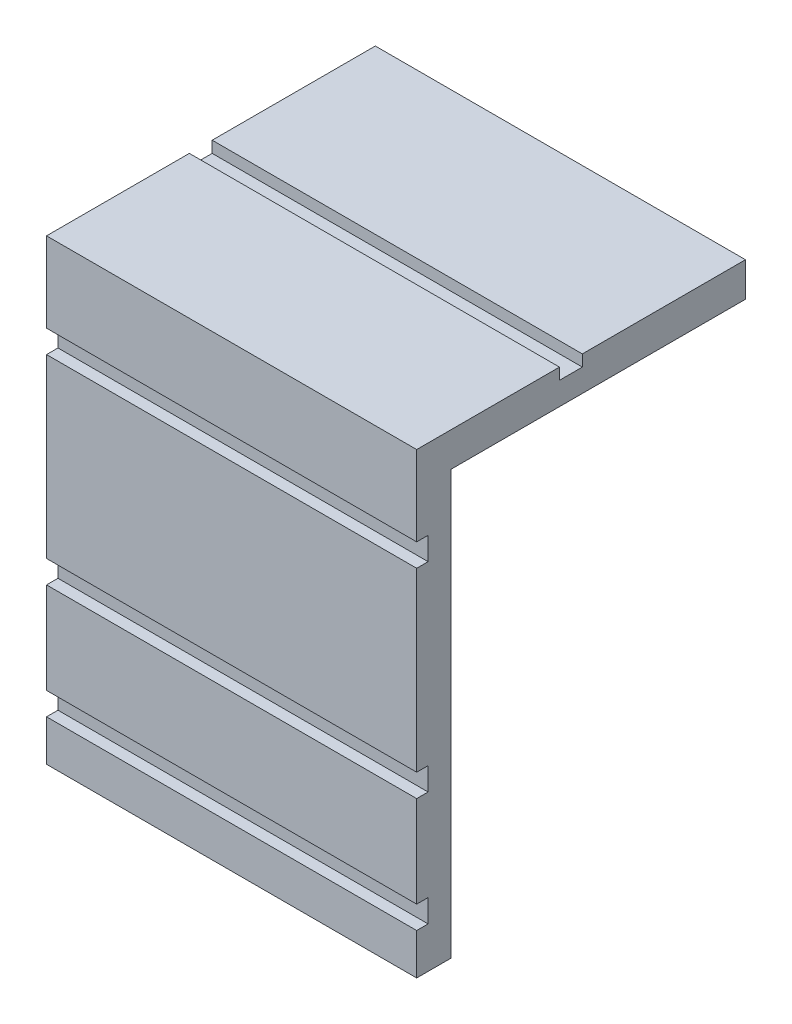
ISO-10303-21;
HEADER;
FILE_DESCRIPTION(('STEP AP214'),'2;1');
FILE_NAME('part.step','',(''),(''),'','','');
FILE_SCHEMA(('AUTOMOTIVE_DESIGN { 1 0 10303 214 1 1 1 1 }'));
ENDSEC;
DATA;
#1=APPLICATION_CONTEXT('core data for automotive mechanical design processes');
#2=APPLICATION_PROTOCOL_DEFINITION('international standard','automotive_design',2000,#1);
#3=PRODUCT_CONTEXT('',#1,'mechanical');
#4=PRODUCT('Part','Part','',(#3));
#5=PRODUCT_RELATED_PRODUCT_CATEGORY('part','',(#4));
#6=PRODUCT_DEFINITION_FORMATION('','',#4);
#7=PRODUCT_DEFINITION_CONTEXT('part definition',#1,'design');
#8=PRODUCT_DEFINITION('design','',#6,#7);
#9=PRODUCT_DEFINITION_SHAPE('','',#8);
#10=(LENGTH_UNIT() NAMED_UNIT(*) SI_UNIT(.MILLI.,.METRE.));
#11=(NAMED_UNIT(*) PLANE_ANGLE_UNIT() SI_UNIT($,.RADIAN.));
#12=(NAMED_UNIT(*) SI_UNIT($,.STERADIAN.) SOLID_ANGLE_UNIT());
#13=UNCERTAINTY_MEASURE_WITH_UNIT(LENGTH_MEASURE(1.E-05),#10,'distance_accuracy_value','');
#14=(GEOMETRIC_REPRESENTATION_CONTEXT(3) GLOBAL_UNCERTAINTY_ASSIGNED_CONTEXT((#13)) GLOBAL_UNIT_ASSIGNED_CONTEXT((#10,
#11,#12)) REPRESENTATION_CONTEXT('',''));
#15=CARTESIAN_POINT('',(0.,0.,0.));
#16=DIRECTION('',(0.,0.,1.));
#17=DIRECTION('',(1.,0.,0.));
#18=AXIS2_PLACEMENT_3D('',#15,#16,#17);
#19=CARTESIAN_POINT('',(16.2,0.,-1.5));
#20=DIRECTION('',(0.,1.,0.));
#21=DIRECTION('',(0.,0.,1.));
#22=AXIS2_PLACEMENT_3D('',#19,#20,#21);
#23=PLANE('',#22);
#24=DIRECTION('',(0.,0.,-1.));
#25=VECTOR('',#24,1.);
#26=CARTESIAN_POINT('',(0.,0.,-1.5));
#27=LINE('',#26,#25);
#28=CARTESIAN_POINT('',(0.,0.,0.));
#29=VERTEX_POINT('',#28);
#30=CARTESIAN_POINT('',(0.,0.,-1.5));
#31=VERTEX_POINT('',#30);
#32=EDGE_CURVE('E214',#29,#31,#27,.T.);
#33=ORIENTED_EDGE('',*,*,#32,.T.);
#34=DIRECTION('',(-1.,0.,0.));
#35=VECTOR('',#34,1.);
#36=CARTESIAN_POINT('',(16.2,0.,-1.5));
#37=LINE('',#36,#35);
#38=CARTESIAN_POINT('',(16.2,0.,-1.5));
#39=VERTEX_POINT('',#38);
#40=EDGE_CURVE('E11',#39,#31,#37,.T.);
#41=ORIENTED_EDGE('',*,*,#40,.F.);
#42=DIRECTION('',(0.,0.,-1.));
#43=VECTOR('',#42,1.);
#44=CARTESIAN_POINT('',(16.2,0.,-1.5));
#45=LINE('',#44,#43);
#46=CARTESIAN_POINT('',(16.2,0.,0.));
#47=VERTEX_POINT('',#46);
#48=EDGE_CURVE('E256',#47,#39,#45,.T.);
#49=ORIENTED_EDGE('',*,*,#48,.F.);
#50=DIRECTION('',(-1.,0.,0.));
#51=VECTOR('',#50,1.);
#52=CARTESIAN_POINT('',(16.2,0.,0.));
#53=LINE('',#52,#51);
#54=EDGE_CURVE('E210',#47,#29,#53,.T.);
#55=ORIENTED_EDGE('',*,*,#54,.T.);
#56=EDGE_LOOP('',(#33,#41,#49,#55));
#57=FACE_BOUND('',#56,.T.);
#58=ADVANCED_FACE('F34',(#57),#23,.F.);
#59=CARTESIAN_POINT('',(16.2,18.53,-1.5));
#60=DIRECTION('',(0.,0.,1.));
#61=DIRECTION('',(0.,-1.,0.));
#62=AXIS2_PLACEMENT_3D('',#59,#60,#61);
#63=PLANE('',#62);
#64=DIRECTION('',(0.,1.,0.));
#65=VECTOR('',#64,1.);
#66=CARTESIAN_POINT('',(0.,18.53,-1.5));
#67=LINE('',#66,#65);
#68=CARTESIAN_POINT('',(0.,18.53,-1.5));
#69=VERTEX_POINT('',#68);
#70=EDGE_CURVE('E217',#31,#69,#67,.T.);
#71=ORIENTED_EDGE('',*,*,#70,.T.);
#72=DIRECTION('',(-1.,0.,0.));
#73=VECTOR('',#72,1.);
#74=CARTESIAN_POINT('',(16.2,18.53,-1.5));
#75=LINE('',#74,#73);
#76=CARTESIAN_POINT('',(16.2,18.53,-1.5));
#77=VERTEX_POINT('',#76);
#78=EDGE_CURVE('E42',#77,#69,#75,.T.);
#79=ORIENTED_EDGE('',*,*,#78,.F.);
#80=DIRECTION('',(0.,1.,0.));
#81=VECTOR('',#80,1.);
#82=CARTESIAN_POINT('',(16.2,18.53,-1.5));
#83=LINE('',#82,#81);
#84=EDGE_CURVE('E135',#39,#77,#83,.T.);
#85=ORIENTED_EDGE('',*,*,#84,.F.);
#86=ORIENTED_EDGE('',*,*,#40,.T.);
#87=EDGE_LOOP('',(#71,#79,#85,#86));
#88=FACE_BOUND('',#87,.T.);
#89=ADVANCED_FACE('F384',(#88),#63,.F.);
#90=CARTESIAN_POINT('',(16.2,18.53,-14.39));
#91=DIRECTION('',(0.,1.,0.));
#92=DIRECTION('',(0.,0.,1.));
#93=AXIS2_PLACEMENT_3D('',#90,#91,#92);
#94=PLANE('',#93);
#95=DIRECTION('',(0.,0.,-1.));
#96=VECTOR('',#95,1.);
#97=CARTESIAN_POINT('',(0.,18.53,-14.39));
#98=LINE('',#97,#96);
#99=CARTESIAN_POINT('',(0.,18.53,-14.39));
#100=VERTEX_POINT('',#99);
#101=EDGE_CURVE('E219',#69,#100,#98,.T.);
#102=ORIENTED_EDGE('',*,*,#101,.T.);
#103=DIRECTION('',(-1.,0.,0.));
#104=VECTOR('',#103,1.);
#105=CARTESIAN_POINT('',(16.2,18.53,-14.39));
#106=LINE('',#105,#104);
#107=CARTESIAN_POINT('',(16.2,18.53,-14.39));
#108=VERTEX_POINT('',#107);
#109=EDGE_CURVE('E305',#108,#100,#106,.T.);
#110=ORIENTED_EDGE('',*,*,#109,.F.);
#111=DIRECTION('',(0.,0.,-1.));
#112=VECTOR('',#111,1.);
#113=CARTESIAN_POINT('',(16.2,18.53,-14.39));
#114=LINE('',#113,#112);
#115=EDGE_CURVE('E313',#77,#108,#114,.T.);
#116=ORIENTED_EDGE('',*,*,#115,.F.);
#117=ORIENTED_EDGE('',*,*,#78,.T.);
#118=EDGE_LOOP('',(#102,#110,#116,#117));
#119=FACE_BOUND('',#118,.T.);
#120=ADVANCED_FACE('F311',(#119),#94,.F.);
#121=CARTESIAN_POINT('',(16.2,20.03,-14.39));
#122=DIRECTION('',(0.,0.,1.));
#123=DIRECTION('',(1.,0.,0.));
#124=AXIS2_PLACEMENT_3D('',#121,#122,#123);
#125=PLANE('',#124);
#126=DIRECTION('',(0.,1.,0.));
#127=VECTOR('',#126,1.);
#128=CARTESIAN_POINT('',(0.,20.03,-14.39));
#129=LINE('',#128,#127);
#130=CARTESIAN_POINT('',(0.,20.03,-14.39));
#131=VERTEX_POINT('',#130);
#132=EDGE_CURVE('E221',#100,#131,#129,.T.);
#133=ORIENTED_EDGE('',*,*,#132,.T.);
#134=DIRECTION('',(-1.,0.,0.));
#135=VECTOR('',#134,1.);
#136=CARTESIAN_POINT('',(16.2,20.03,-14.39));
#137=LINE('',#136,#135);
#138=CARTESIAN_POINT('',(16.2,20.03,-14.39));
#139=VERTEX_POINT('',#138);
#140=EDGE_CURVE('E302',#139,#131,#137,.T.);
#141=ORIENTED_EDGE('',*,*,#140,.F.);
#142=DIRECTION('',(0.,1.,0.));
#143=VECTOR('',#142,1.);
#144=CARTESIAN_POINT('',(16.2,20.03,-14.39));
#145=LINE('',#144,#143);
#146=EDGE_CURVE('E331',#108,#139,#145,.T.);
#147=ORIENTED_EDGE('',*,*,#146,.F.);
#148=ORIENTED_EDGE('',*,*,#109,.T.);
#149=EDGE_LOOP('',(#133,#141,#147,#148));
#150=FACE_BOUND('',#149,.T.);
#151=ADVANCED_FACE('F322',(#150),#125,.F.);
#152=CARTESIAN_POINT('',(16.2,20.03,-7.25));
#153=DIRECTION('',(0.,-1.,0.));
#154=DIRECTION('',(0.,0.,-1.));
#155=AXIS2_PLACEMENT_3D('',#152,#153,#154);
#156=PLANE('',#155);
#157=DIRECTION('',(0.,0.,1.));
#158=VECTOR('',#157,1.);
#159=CARTESIAN_POINT('',(0.,20.03,-7.25));
#160=LINE('',#159,#158);
#161=CARTESIAN_POINT('',(0.,20.03,-7.25));
#162=VERTEX_POINT('',#161);
#163=EDGE_CURVE('E223',#131,#162,#160,.T.);
#164=ORIENTED_EDGE('',*,*,#163,.T.);
#165=DIRECTION('',(-1.,0.,0.));
#166=VECTOR('',#165,1.);
#167=CARTESIAN_POINT('',(16.2,20.03,-7.25));
#168=LINE('',#167,#166);
#169=CARTESIAN_POINT('',(16.2,20.03,-7.25));
#170=VERTEX_POINT('',#169);
#171=EDGE_CURVE('E299',#170,#162,#168,.T.);
#172=ORIENTED_EDGE('',*,*,#171,.F.);
#173=DIRECTION('',(0.,0.,1.));
#174=VECTOR('',#173,1.);
#175=CARTESIAN_POINT('',(16.2,20.03,-7.25));
#176=LINE('',#175,#174);
#177=EDGE_CURVE('E328',#139,#170,#176,.T.);
#178=ORIENTED_EDGE('',*,*,#177,.F.);
#179=ORIENTED_EDGE('',*,*,#140,.T.);
#180=EDGE_LOOP('',(#164,#172,#178,#179));
#181=FACE_BOUND('',#180,.T.);
#182=ADVANCED_FACE('F326',(#181),#156,.F.);
#183=CARTESIAN_POINT('',(16.2,19.53,-7.25));
#184=DIRECTION('',(0.,0.,-1.));
#185=DIRECTION('',(-1.,0.,0.));
#186=AXIS2_PLACEMENT_3D('',#183,#184,#185);
#187=PLANE('',#186);
#188=DIRECTION('',(0.,-1.,0.));
#189=VECTOR('',#188,1.);
#190=CARTESIAN_POINT('',(0.,19.53,-7.25));
#191=LINE('',#190,#189);
#192=CARTESIAN_POINT('',(0.,19.53,-7.25));
#193=VERTEX_POINT('',#192);
#194=EDGE_CURVE('E225',#162,#193,#191,.T.);
#195=ORIENTED_EDGE('',*,*,#194,.T.);
#196=DIRECTION('',(-1.,0.,0.));
#197=VECTOR('',#196,1.);
#198=CARTESIAN_POINT('',(16.2,19.53,-7.25));
#199=LINE('',#198,#197);
#200=CARTESIAN_POINT('',(16.2,19.53,-7.25));
#201=VERTEX_POINT('',#200);
#202=EDGE_CURVE('E296',#201,#193,#199,.T.);
#203=ORIENTED_EDGE('',*,*,#202,.F.);
#204=DIRECTION('',(0.,-1.,0.));
#205=VECTOR('',#204,1.);
#206=CARTESIAN_POINT('',(16.2,19.53,-7.25));
#207=LINE('',#206,#205);
#208=EDGE_CURVE('E330',#170,#201,#207,.T.);
#209=ORIENTED_EDGE('',*,*,#208,.F.);
#210=ORIENTED_EDGE('',*,*,#171,.T.);
#211=EDGE_LOOP('',(#195,#203,#209,#210));
#212=FACE_BOUND('',#211,.T.);
#213=ADVANCED_FACE('F397',(#212),#187,.F.);
#214=CARTESIAN_POINT('',(16.2,19.53,-6.25));
#215=DIRECTION('',(0.,-1.,0.));
#216=DIRECTION('',(0.,0.,-1.));
#217=AXIS2_PLACEMENT_3D('',#214,#215,#216);
#218=PLANE('',#217);
#219=DIRECTION('',(0.,0.,1.));
#220=VECTOR('',#219,1.);
#221=CARTESIAN_POINT('',(0.,19.53,-6.25));
#222=LINE('',#221,#220);
#223=CARTESIAN_POINT('',(0.,19.53,-6.25));
#224=VERTEX_POINT('',#223);
#225=EDGE_CURVE('E227',#193,#224,#222,.T.);
#226=ORIENTED_EDGE('',*,*,#225,.T.);
#227=DIRECTION('',(-1.,0.,0.));
#228=VECTOR('',#227,1.);
#229=CARTESIAN_POINT('',(16.2,19.53,-6.25));
#230=LINE('',#229,#228);
#231=CARTESIAN_POINT('',(16.2,19.53,-6.25));
#232=VERTEX_POINT('',#231);
#233=EDGE_CURVE('E293',#232,#224,#230,.T.);
#234=ORIENTED_EDGE('',*,*,#233,.F.);
#235=DIRECTION('',(0.,0.,1.));
#236=VECTOR('',#235,1.);
#237=CARTESIAN_POINT('',(16.2,19.53,-6.25));
#238=LINE('',#237,#236);
#239=EDGE_CURVE('E333',#201,#232,#238,.T.);
#240=ORIENTED_EDGE('',*,*,#239,.F.);
#241=ORIENTED_EDGE('',*,*,#202,.T.);
#242=EDGE_LOOP('',(#226,#234,#240,#241));
#243=FACE_BOUND('',#242,.T.);
#244=ADVANCED_FACE('F400',(#243),#218,.F.);
#245=CARTESIAN_POINT('',(16.2,20.03,-6.25));
#246=DIRECTION('',(0.,0.,1.));
#247=DIRECTION('',(1.,0.,0.));
#248=AXIS2_PLACEMENT_3D('',#245,#246,#247);
#249=PLANE('',#248);
#250=DIRECTION('',(0.,1.,0.));
#251=VECTOR('',#250,1.);
#252=CARTESIAN_POINT('',(0.,20.03,-6.25));
#253=LINE('',#252,#251);
#254=CARTESIAN_POINT('',(0.,20.03,-6.25));
#255=VERTEX_POINT('',#254);
#256=EDGE_CURVE('E229',#224,#255,#253,.T.);
#257=ORIENTED_EDGE('',*,*,#256,.T.);
#258=DIRECTION('',(-1.,0.,0.));
#259=VECTOR('',#258,1.);
#260=CARTESIAN_POINT('',(16.2,20.03,-6.25));
#261=LINE('',#260,#259);
#262=CARTESIAN_POINT('',(16.2,20.03,-6.25));
#263=VERTEX_POINT('',#262);
#264=EDGE_CURVE('E290',#263,#255,#261,.T.);
#265=ORIENTED_EDGE('',*,*,#264,.F.);
#266=DIRECTION('',(0.,1.,0.));
#267=VECTOR('',#266,1.);
#268=CARTESIAN_POINT('',(16.2,20.03,-6.25));
#269=LINE('',#268,#267);
#270=EDGE_CURVE('E339',#232,#263,#269,.T.);
#271=ORIENTED_EDGE('',*,*,#270,.F.);
#272=ORIENTED_EDGE('',*,*,#233,.T.);
#273=EDGE_LOOP('',(#257,#265,#271,#272));
#274=FACE_BOUND('',#273,.T.);
#275=ADVANCED_FACE('F404',(#274),#249,.F.);
#276=CARTESIAN_POINT('',(16.2,20.03,0.));
#277=DIRECTION('',(0.,-1.,0.));
#278=DIRECTION('',(0.,0.,-1.));
#279=AXIS2_PLACEMENT_3D('',#276,#277,#278);
#280=PLANE('',#279);
#281=DIRECTION('',(0.,0.,1.));
#282=VECTOR('',#281,1.);
#283=CARTESIAN_POINT('',(0.,20.03,0.));
#284=LINE('',#283,#282);
#285=CARTESIAN_POINT('',(0.,20.03,0.));
#286=VERTEX_POINT('',#285);
#287=EDGE_CURVE('E231',#255,#286,#284,.T.);
#288=ORIENTED_EDGE('',*,*,#287,.T.);
#289=DIRECTION('',(-1.,0.,0.));
#290=VECTOR('',#289,1.);
#291=CARTESIAN_POINT('',(16.2,20.03,0.));
#292=LINE('',#291,#290);
#293=CARTESIAN_POINT('',(16.2,20.03,0.));
#294=VERTEX_POINT('',#293);
#295=EDGE_CURVE('E287',#294,#286,#292,.T.);
#296=ORIENTED_EDGE('',*,*,#295,.F.);
#297=DIRECTION('',(0.,0.,1.));
#298=VECTOR('',#297,1.);
#299=CARTESIAN_POINT('',(16.2,20.03,0.));
#300=LINE('',#299,#298);
#301=EDGE_CURVE('E341',#263,#294,#300,.T.);
#302=ORIENTED_EDGE('',*,*,#301,.F.);
#303=ORIENTED_EDGE('',*,*,#264,.T.);
#304=EDGE_LOOP('',(#288,#296,#302,#303));
#305=FACE_BOUND('',#304,.T.);
#306=ADVANCED_FACE('F408',(#305),#280,.F.);
#307=CARTESIAN_POINT('',(16.2,16.53,0.));
#308=DIRECTION('',(0.,0.,-1.));
#309=DIRECTION('',(-1.,0.,0.));
#310=AXIS2_PLACEMENT_3D('',#307,#308,#309);
#311=PLANE('',#310);
#312=DIRECTION('',(0.,-1.,0.));
#313=VECTOR('',#312,1.);
#314=CARTESIAN_POINT('',(0.,16.53,0.));
#315=LINE('',#314,#313);
#316=CARTESIAN_POINT('',(0.,16.53,0.));
#317=VERTEX_POINT('',#316);
#318=EDGE_CURVE('E233',#286,#317,#315,.T.);
#319=ORIENTED_EDGE('',*,*,#318,.T.);
#320=DIRECTION('',(-1.,0.,0.));
#321=VECTOR('',#320,1.);
#322=CARTESIAN_POINT('',(16.2,16.53,0.));
#323=LINE('',#322,#321);
#324=CARTESIAN_POINT('',(16.2,16.53,0.));
#325=VERTEX_POINT('',#324);
#326=EDGE_CURVE('E284',#325,#317,#323,.T.);
#327=ORIENTED_EDGE('',*,*,#326,.F.);
#328=DIRECTION('',(0.,-1.,0.));
#329=VECTOR('',#328,1.);
#330=CARTESIAN_POINT('',(16.2,16.53,0.));
#331=LINE('',#330,#329);
#332=EDGE_CURVE('E343',#294,#325,#331,.T.);
#333=ORIENTED_EDGE('',*,*,#332,.F.);
#334=ORIENTED_EDGE('',*,*,#295,.T.);
#335=EDGE_LOOP('',(#319,#327,#333,#334));
#336=FACE_BOUND('',#335,.T.);
#337=ADVANCED_FACE('F412',(#336),#311,.F.);
#338=CARTESIAN_POINT('',(16.2,16.53,0.));
#339=DIRECTION('',(0.,1.,0.));
#340=DIRECTION('',(0.,0.,1.));
#341=AXIS2_PLACEMENT_3D('',#338,#339,#340);
#342=PLANE('',#341);
#343=DIRECTION('',(0.,0.,-1.));
#344=VECTOR('',#343,1.);
#345=CARTESIAN_POINT('',(0.,16.53,0.));
#346=LINE('',#345,#344);
#347=CARTESIAN_POINT('',(0.,16.53,-0.5));
#348=VERTEX_POINT('',#347);
#349=EDGE_CURVE('E235',#317,#348,#346,.T.);
#350=ORIENTED_EDGE('',*,*,#349,.T.);
#351=DIRECTION('',(-1.,0.,0.));
#352=VECTOR('',#351,1.);
#353=CARTESIAN_POINT('',(16.2,16.53,-0.5));
#354=LINE('',#353,#352);
#355=CARTESIAN_POINT('',(16.2,16.53,-0.5));
#356=VERTEX_POINT('',#355);
#357=EDGE_CURVE('E281',#356,#348,#354,.T.);
#358=ORIENTED_EDGE('',*,*,#357,.F.);
#359=DIRECTION('',(0.,0.,-1.));
#360=VECTOR('',#359,1.);
#361=CARTESIAN_POINT('',(16.2,16.53,0.));
#362=LINE('',#361,#360);
#363=EDGE_CURVE('E345',#325,#356,#362,.T.);
#364=ORIENTED_EDGE('',*,*,#363,.F.);
#365=ORIENTED_EDGE('',*,*,#326,.T.);
#366=EDGE_LOOP('',(#350,#358,#364,#365));
#367=FACE_BOUND('',#366,.T.);
#368=ADVANCED_FACE('F416',(#367),#342,.F.);
#369=CARTESIAN_POINT('',(16.2,16.53,-0.5));
#370=DIRECTION('',(0.,0.,-1.));
#371=DIRECTION('',(0.,1.,0.));
#372=AXIS2_PLACEMENT_3D('',#369,#370,#371);
#373=PLANE('',#372);
#374=DIRECTION('',(0.,-1.,0.));
#375=VECTOR('',#374,1.);
#376=CARTESIAN_POINT('',(0.,16.53,-0.5));
#377=LINE('',#376,#375);
#378=CARTESIAN_POINT('',(0.,15.53,-0.5));
#379=VERTEX_POINT('',#378);
#380=EDGE_CURVE('E237',#348,#379,#377,.T.);
#381=ORIENTED_EDGE('',*,*,#380,.T.);
#382=DIRECTION('',(-1.,0.,0.));
#383=VECTOR('',#382,1.);
#384=CARTESIAN_POINT('',(16.2,15.53,-0.5));
#385=LINE('',#384,#383);
#386=CARTESIAN_POINT('',(16.2,15.53,-0.5));
#387=VERTEX_POINT('',#386);
#388=EDGE_CURVE('E278',#387,#379,#385,.T.);
#389=ORIENTED_EDGE('',*,*,#388,.F.);
#390=DIRECTION('',(0.,-1.,0.));
#391=VECTOR('',#390,1.);
#392=CARTESIAN_POINT('',(16.2,16.53,-0.5));
#393=LINE('',#392,#391);
#394=EDGE_CURVE('E347',#356,#387,#393,.T.);
#395=ORIENTED_EDGE('',*,*,#394,.F.);
#396=ORIENTED_EDGE('',*,*,#357,.T.);
#397=EDGE_LOOP('',(#381,#389,#395,#396));
#398=FACE_BOUND('',#397,.T.);
#399=ADVANCED_FACE('F420',(#398),#373,.F.);
#400=CARTESIAN_POINT('',(16.2,15.53,-0.5));
#401=DIRECTION('',(0.,-1.,0.));
#402=DIRECTION('',(0.,0.,-1.));
#403=AXIS2_PLACEMENT_3D('',#400,#401,#402);
#404=PLANE('',#403);
#405=DIRECTION('',(0.,0.,1.));
#406=VECTOR('',#405,1.);
#407=CARTESIAN_POINT('',(0.,15.53,-0.5));
#408=LINE('',#407,#406);
#409=CARTESIAN_POINT('',(0.,15.53,0.));
#410=VERTEX_POINT('',#409);
#411=EDGE_CURVE('E239',#379,#410,#408,.T.);
#412=ORIENTED_EDGE('',*,*,#411,.T.);
#413=DIRECTION('',(-1.,0.,0.));
#414=VECTOR('',#413,1.);
#415=CARTESIAN_POINT('',(16.2,15.53,0.));
#416=LINE('',#415,#414);
#417=CARTESIAN_POINT('',(16.2,15.53,0.));
#418=VERTEX_POINT('',#417);
#419=EDGE_CURVE('E275',#418,#410,#416,.T.);
#420=ORIENTED_EDGE('',*,*,#419,.F.);
#421=DIRECTION('',(0.,0.,1.));
#422=VECTOR('',#421,1.);
#423=CARTESIAN_POINT('',(16.2,15.53,-0.5));
#424=LINE('',#423,#422);
#425=EDGE_CURVE('E349',#387,#418,#424,.T.);
#426=ORIENTED_EDGE('',*,*,#425,.F.);
#427=ORIENTED_EDGE('',*,*,#388,.T.);
#428=EDGE_LOOP('',(#412,#420,#426,#427));
#429=FACE_BOUND('',#428,.T.);
#430=ADVANCED_FACE('F424',(#429),#404,.F.);
#431=CARTESIAN_POINT('',(16.2,7.8,0.));
#432=DIRECTION('',(0.,0.,-1.));
#433=DIRECTION('',(-1.,0.,0.));
#434=AXIS2_PLACEMENT_3D('',#431,#432,#433);
#435=PLANE('',#434);
#436=DIRECTION('',(0.,-1.,0.));
#437=VECTOR('',#436,1.);
#438=CARTESIAN_POINT('',(0.,7.8,0.));
#439=LINE('',#438,#437);
#440=CARTESIAN_POINT('',(0.,7.8,0.));
#441=VERTEX_POINT('',#440);
#442=EDGE_CURVE('E241',#410,#441,#439,.T.);
#443=ORIENTED_EDGE('',*,*,#442,.T.);
#444=DIRECTION('',(-1.,0.,0.));
#445=VECTOR('',#444,1.);
#446=CARTESIAN_POINT('',(16.2,7.8,0.));
#447=LINE('',#446,#445);
#448=CARTESIAN_POINT('',(16.2,7.8,0.));
#449=VERTEX_POINT('',#448);
#450=EDGE_CURVE('E272',#449,#441,#447,.T.);
#451=ORIENTED_EDGE('',*,*,#450,.F.);
#452=DIRECTION('',(0.,-1.,0.));
#453=VECTOR('',#452,1.);
#454=CARTESIAN_POINT('',(16.2,7.8,0.));
#455=LINE('',#454,#453);
#456=EDGE_CURVE('E351',#418,#449,#455,.T.);
#457=ORIENTED_EDGE('',*,*,#456,.F.);
#458=ORIENTED_EDGE('',*,*,#419,.T.);
#459=EDGE_LOOP('',(#443,#451,#457,#458));
#460=FACE_BOUND('',#459,.T.);
#461=ADVANCED_FACE('F428',(#460),#435,.F.);
#462=CARTESIAN_POINT('',(16.2,7.8,0.));
#463=DIRECTION('',(0.,1.,0.));
#464=DIRECTION('',(0.,0.,1.));
#465=AXIS2_PLACEMENT_3D('',#462,#463,#464);
#466=PLANE('',#465);
#467=DIRECTION('',(0.,0.,-1.));
#468=VECTOR('',#467,1.);
#469=CARTESIAN_POINT('',(0.,7.8,0.));
#470=LINE('',#469,#468);
#471=CARTESIAN_POINT('',(0.,7.8,-0.499999999999998));
#472=VERTEX_POINT('',#471);
#473=EDGE_CURVE('E243',#441,#472,#470,.T.);
#474=ORIENTED_EDGE('',*,*,#473,.T.);
#475=DIRECTION('',(-1.,0.,0.));
#476=VECTOR('',#475,1.);
#477=CARTESIAN_POINT('',(16.2,7.8,-0.499999999999998));
#478=LINE('',#477,#476);
#479=CARTESIAN_POINT('',(16.2,7.8,-0.499999999999998));
#480=VERTEX_POINT('',#479);
#481=EDGE_CURVE('E269',#480,#472,#478,.T.);
#482=ORIENTED_EDGE('',*,*,#481,.F.);
#483=DIRECTION('',(0.,0.,-1.));
#484=VECTOR('',#483,1.);
#485=CARTESIAN_POINT('',(16.2,7.8,0.));
#486=LINE('',#485,#484);
#487=EDGE_CURVE('E353',#449,#480,#486,.T.);
#488=ORIENTED_EDGE('',*,*,#487,.F.);
#489=ORIENTED_EDGE('',*,*,#450,.T.);
#490=EDGE_LOOP('',(#474,#482,#488,#489));
#491=FACE_BOUND('',#490,.T.);
#492=ADVANCED_FACE('F432',(#491),#466,.F.);
#493=CARTESIAN_POINT('',(16.2,7.8,-0.499999999999998));
#494=DIRECTION('',(0.,0.,-1.));
#495=DIRECTION('',(0.,1.,0.));
#496=AXIS2_PLACEMENT_3D('',#493,#494,#495);
#497=PLANE('',#496);
#498=DIRECTION('',(0.,-1.,0.));
#499=VECTOR('',#498,1.);
#500=CARTESIAN_POINT('',(0.,7.8,-0.499999999999998));
#501=LINE('',#500,#499);
#502=CARTESIAN_POINT('',(0.,6.8,-0.499999999999999));
#503=VERTEX_POINT('',#502);
#504=EDGE_CURVE('E245',#472,#503,#501,.T.);
#505=ORIENTED_EDGE('',*,*,#504,.T.);
#506=DIRECTION('',(-1.,0.,0.));
#507=VECTOR('',#506,1.);
#508=CARTESIAN_POINT('',(16.2,6.8,-0.499999999999999));
#509=LINE('',#508,#507);
#510=CARTESIAN_POINT('',(16.2,6.8,-0.499999999999999));
#511=VERTEX_POINT('',#510);
#512=EDGE_CURVE('E266',#511,#503,#509,.T.);
#513=ORIENTED_EDGE('',*,*,#512,.F.);
#514=DIRECTION('',(0.,-1.,0.));
#515=VECTOR('',#514,1.);
#516=CARTESIAN_POINT('',(16.2,7.8,-0.499999999999998));
#517=LINE('',#516,#515);
#518=EDGE_CURVE('E355',#480,#511,#517,.T.);
#519=ORIENTED_EDGE('',*,*,#518,.F.);
#520=ORIENTED_EDGE('',*,*,#481,.T.);
#521=EDGE_LOOP('',(#505,#513,#519,#520));
#522=FACE_BOUND('',#521,.T.);
#523=ADVANCED_FACE('F436',(#522),#497,.F.);
#524=CARTESIAN_POINT('',(16.2,6.8,-0.499999999999999));
#525=DIRECTION('',(0.,-1.,0.));
#526=DIRECTION('',(0.,0.,-1.));
#527=AXIS2_PLACEMENT_3D('',#524,#525,#526);
#528=PLANE('',#527);
#529=DIRECTION('',(0.,0.,1.));
#530=VECTOR('',#529,1.);
#531=CARTESIAN_POINT('',(0.,6.8,-0.499999999999999));
#532=LINE('',#531,#530);
#533=CARTESIAN_POINT('',(0.,6.8,0.));
#534=VERTEX_POINT('',#533);
#535=EDGE_CURVE('E247',#503,#534,#532,.T.);
#536=ORIENTED_EDGE('',*,*,#535,.T.);
#537=DIRECTION('',(-1.,0.,0.));
#538=VECTOR('',#537,1.);
#539=CARTESIAN_POINT('',(16.2,6.8,0.));
#540=LINE('',#539,#538);
#541=CARTESIAN_POINT('',(16.2,6.8,0.));
#542=VERTEX_POINT('',#541);
#543=EDGE_CURVE('E263',#542,#534,#540,.T.);
#544=ORIENTED_EDGE('',*,*,#543,.F.);
#545=DIRECTION('',(0.,0.,1.));
#546=VECTOR('',#545,1.);
#547=CARTESIAN_POINT('',(16.2,6.8,-0.499999999999999));
#548=LINE('',#547,#546);
#549=EDGE_CURVE('E357',#511,#542,#548,.T.);
#550=ORIENTED_EDGE('',*,*,#549,.F.);
#551=ORIENTED_EDGE('',*,*,#512,.T.);
#552=EDGE_LOOP('',(#536,#544,#550,#551));
#553=FACE_BOUND('',#552,.T.);
#554=ADVANCED_FACE('F440',(#553),#528,.F.);
#555=CARTESIAN_POINT('',(16.2,2.8,0.));
#556=DIRECTION('',(0.,0.,-1.));
#557=DIRECTION('',(0.,1.,0.));
#558=AXIS2_PLACEMENT_3D('',#555,#556,#557);
#559=PLANE('',#558);
#560=DIRECTION('',(0.,-1.,0.));
#561=VECTOR('',#560,1.);
#562=CARTESIAN_POINT('',(0.,2.8,0.));
#563=LINE('',#562,#561);
#564=CARTESIAN_POINT('',(0.,2.8,0.));
#565=VERTEX_POINT('',#564);
#566=EDGE_CURVE('E249',#534,#565,#563,.T.);
#567=ORIENTED_EDGE('',*,*,#566,.T.);
#568=DIRECTION('',(-1.,0.,0.));
#569=VECTOR('',#568,1.);
#570=CARTESIAN_POINT('',(16.2,2.8,0.));
#571=LINE('',#570,#569);
#572=CARTESIAN_POINT('',(16.2,2.8,0.));
#573=VERTEX_POINT('',#572);
#574=EDGE_CURVE('E260',#573,#565,#571,.T.);
#575=ORIENTED_EDGE('',*,*,#574,.F.);
#576=DIRECTION('',(0.,-1.,0.));
#577=VECTOR('',#576,1.);
#578=CARTESIAN_POINT('',(16.2,2.8,0.));
#579=LINE('',#578,#577);
#580=EDGE_CURVE('E359',#542,#573,#579,.T.);
#581=ORIENTED_EDGE('',*,*,#580,.F.);
#582=ORIENTED_EDGE('',*,*,#543,.T.);
#583=EDGE_LOOP('',(#567,#575,#581,#582));
#584=FACE_BOUND('',#583,.T.);
#585=ADVANCED_FACE('F365',(#584),#559,.F.);
#586=CARTESIAN_POINT('',(16.2,2.8,-0.5));
#587=DIRECTION('',(0.,1.,0.));
#588=DIRECTION('',(0.,0.,1.));
#589=AXIS2_PLACEMENT_3D('',#586,#587,#588);
#590=PLANE('',#589);
#591=DIRECTION('',(0.,0.,-1.));
#592=VECTOR('',#591,1.);
#593=CARTESIAN_POINT('',(0.,2.8,-0.5));
#594=LINE('',#593,#592);
#595=CARTESIAN_POINT('',(0.,2.8,-0.5));
#596=VERTEX_POINT('',#595);
#597=EDGE_CURVE('E251',#565,#596,#594,.T.);
#598=ORIENTED_EDGE('',*,*,#597,.T.);
#599=DIRECTION('',(-1.,0.,0.));
#600=VECTOR('',#599,1.);
#601=CARTESIAN_POINT('',(16.2,2.8,-0.5));
#602=LINE('',#601,#600);
#603=CARTESIAN_POINT('',(16.2,2.8,-0.5));
#604=VERTEX_POINT('',#603);
#605=EDGE_CURVE('E205',#604,#596,#602,.T.);
#606=ORIENTED_EDGE('',*,*,#605,.F.);
#607=DIRECTION('',(0.,0.,-1.));
#608=VECTOR('',#607,1.);
#609=CARTESIAN_POINT('',(16.2,2.8,-0.5));
#610=LINE('',#609,#608);
#611=EDGE_CURVE('E196',#573,#604,#610,.T.);
#612=ORIENTED_EDGE('',*,*,#611,.F.);
#613=ORIENTED_EDGE('',*,*,#574,.T.);
#614=EDGE_LOOP('',(#598,#606,#612,#613));
#615=FACE_BOUND('',#614,.T.);
#616=ADVANCED_FACE('F369',(#615),#590,.F.);
#617=CARTESIAN_POINT('',(16.2,1.8,-0.5));
#618=DIRECTION('',(0.,0.,-1.));
#619=DIRECTION('',(-1.,0.,0.));
#620=AXIS2_PLACEMENT_3D('',#617,#618,#619);
#621=PLANE('',#620);
#622=DIRECTION('',(0.,-1.,0.));
#623=VECTOR('',#622,1.);
#624=CARTESIAN_POINT('',(0.,1.8,-0.5));
#625=LINE('',#624,#623);
#626=CARTESIAN_POINT('',(0.,1.8,-0.5));
#627=VERTEX_POINT('',#626);
#628=EDGE_CURVE('E204',#596,#627,#625,.T.);
#629=ORIENTED_EDGE('',*,*,#628,.T.);
#630=DIRECTION('',(-1.,0.,0.));
#631=VECTOR('',#630,1.);
#632=CARTESIAN_POINT('',(16.2,1.8,-0.5));
#633=LINE('',#632,#631);
#634=CARTESIAN_POINT('',(16.2,1.8,-0.5));
#635=VERTEX_POINT('',#634);
#636=EDGE_CURVE('E201',#635,#627,#633,.T.);
#637=ORIENTED_EDGE('',*,*,#636,.F.);
#638=DIRECTION('',(0.,-1.,0.));
#639=VECTOR('',#638,1.);
#640=CARTESIAN_POINT('',(16.2,1.8,-0.5));
#641=LINE('',#640,#639);
#642=EDGE_CURVE('E190',#604,#635,#641,.T.);
#643=ORIENTED_EDGE('',*,*,#642,.F.);
#644=ORIENTED_EDGE('',*,*,#605,.T.);
#645=EDGE_LOOP('',(#629,#637,#643,#644));
#646=FACE_BOUND('',#645,.T.);
#647=ADVANCED_FACE('F202',(#646),#621,.F.);
#648=CARTESIAN_POINT('',(16.2,1.8,0.));
#649=DIRECTION('',(0.,-1.,0.));
#650=DIRECTION('',(0.,0.,-1.));
#651=AXIS2_PLACEMENT_3D('',#648,#649,#650);
#652=PLANE('',#651);
#653=DIRECTION('',(0.,0.,1.));
#654=VECTOR('',#653,1.);
#655=CARTESIAN_POINT('',(0.,1.8,0.));
#656=LINE('',#655,#654);
#657=CARTESIAN_POINT('',(0.,1.8,0.));
#658=VERTEX_POINT('',#657);
#659=EDGE_CURVE('E121',#627,#658,#656,.T.);
#660=ORIENTED_EDGE('',*,*,#659,.T.);
#661=DIRECTION('',(-1.,0.,0.));
#662=VECTOR('',#661,1.);
#663=CARTESIAN_POINT('',(16.2,1.8,0.));
#664=LINE('',#663,#662);
#665=CARTESIAN_POINT('',(16.2,1.8,0.));
#666=VERTEX_POINT('',#665);
#667=EDGE_CURVE('E206',#666,#658,#664,.T.);
#668=ORIENTED_EDGE('',*,*,#667,.F.);
#669=DIRECTION('',(0.,0.,1.));
#670=VECTOR('',#669,1.);
#671=CARTESIAN_POINT('',(16.2,1.8,0.));
#672=LINE('',#671,#670);
#673=EDGE_CURVE('E194',#635,#666,#672,.T.);
#674=ORIENTED_EDGE('',*,*,#673,.F.);
#675=ORIENTED_EDGE('',*,*,#636,.T.);
#676=EDGE_LOOP('',(#660,#668,#674,#675));
#677=FACE_BOUND('',#676,.T.);
#678=ADVANCED_FACE('F208',(#677),#652,.F.);
#679=CARTESIAN_POINT('',(16.2,0.,0.));
#680=DIRECTION('',(0.,0.,-1.));
#681=DIRECTION('',(-1.,0.,0.));
#682=AXIS2_PLACEMENT_3D('',#679,#680,#681);
#683=PLANE('',#682);
#684=DIRECTION('',(0.,-1.,0.));
#685=VECTOR('',#684,1.);
#686=CARTESIAN_POINT('',(0.,0.,0.));
#687=LINE('',#686,#685);
#688=EDGE_CURVE('E127',#658,#29,#687,.T.);
#689=ORIENTED_EDGE('',*,*,#688,.T.);
#690=ORIENTED_EDGE('',*,*,#54,.F.);
#691=DIRECTION('',(0.,-1.,0.));
#692=VECTOR('',#691,1.);
#693=CARTESIAN_POINT('',(16.2,0.,0.));
#694=LINE('',#693,#692);
#695=EDGE_CURVE('E50',#666,#47,#694,.T.);
#696=ORIENTED_EDGE('',*,*,#695,.F.);
#697=ORIENTED_EDGE('',*,*,#667,.T.);
#698=EDGE_LOOP('',(#689,#690,#696,#697));
#699=FACE_BOUND('',#698,.T.);
#700=ADVANCED_FACE('F373',(#699),#683,.F.);
#701=CARTESIAN_POINT('',(16.2,0.,0.));
#702=DIRECTION('',(-1.,0.,0.));
#703=DIRECTION('',(0.,0.,1.));
#704=AXIS2_PLACEMENT_3D('',#701,#702,#703);
#705=PLANE('',#704);
#706=ORIENTED_EDGE('',*,*,#48,.T.);
#707=ORIENTED_EDGE('',*,*,#84,.T.);
#708=ORIENTED_EDGE('',*,*,#115,.T.);
#709=ORIENTED_EDGE('',*,*,#146,.T.);
#710=ORIENTED_EDGE('',*,*,#177,.T.);
#711=ORIENTED_EDGE('',*,*,#208,.T.);
#712=ORIENTED_EDGE('',*,*,#239,.T.);
#713=ORIENTED_EDGE('',*,*,#270,.T.);
#714=ORIENTED_EDGE('',*,*,#301,.T.);
#715=ORIENTED_EDGE('',*,*,#332,.T.);
#716=ORIENTED_EDGE('',*,*,#363,.T.);
#717=ORIENTED_EDGE('',*,*,#394,.T.);
#718=ORIENTED_EDGE('',*,*,#425,.T.);
#719=ORIENTED_EDGE('',*,*,#456,.T.);
#720=ORIENTED_EDGE('',*,*,#487,.T.);
#721=ORIENTED_EDGE('',*,*,#518,.T.);
#722=ORIENTED_EDGE('',*,*,#549,.T.);
#723=ORIENTED_EDGE('',*,*,#580,.T.);
#724=ORIENTED_EDGE('',*,*,#611,.T.);
#725=ORIENTED_EDGE('',*,*,#642,.T.);
#726=ORIENTED_EDGE('',*,*,#673,.T.);
#727=ORIENTED_EDGE('',*,*,#695,.T.);
#728=EDGE_LOOP('',(#706,#707,#708,#709,#710,#711,#712,#713,#714,#715,#716,#717,#718,#719,#720,
#721,#722,#723,#724,#725,#726,#727));
#729=FACE_BOUND('',#728,.T.);
#730=ADVANCED_FACE('F192',(#729),#705,.F.);
#731=CARTESIAN_POINT('',(0.,0.,0.));
#732=DIRECTION('',(-1.,0.,0.));
#733=DIRECTION('',(0.,0.,1.));
#734=AXIS2_PLACEMENT_3D('',#731,#732,#733);
#735=PLANE('',#734);
#736=ORIENTED_EDGE('',*,*,#32,.F.);
#737=ORIENTED_EDGE('',*,*,#688,.F.);
#738=ORIENTED_EDGE('',*,*,#659,.F.);
#739=ORIENTED_EDGE('',*,*,#628,.F.);
#740=ORIENTED_EDGE('',*,*,#597,.F.);
#741=ORIENTED_EDGE('',*,*,#566,.F.);
#742=ORIENTED_EDGE('',*,*,#535,.F.);
#743=ORIENTED_EDGE('',*,*,#504,.F.);
#744=ORIENTED_EDGE('',*,*,#473,.F.);
#745=ORIENTED_EDGE('',*,*,#442,.F.);
#746=ORIENTED_EDGE('',*,*,#411,.F.);
#747=ORIENTED_EDGE('',*,*,#380,.F.);
#748=ORIENTED_EDGE('',*,*,#349,.F.);
#749=ORIENTED_EDGE('',*,*,#318,.F.);
#750=ORIENTED_EDGE('',*,*,#287,.F.);
#751=ORIENTED_EDGE('',*,*,#256,.F.);
#752=ORIENTED_EDGE('',*,*,#225,.F.);
#753=ORIENTED_EDGE('',*,*,#194,.F.);
#754=ORIENTED_EDGE('',*,*,#163,.F.);
#755=ORIENTED_EDGE('',*,*,#132,.F.);
#756=ORIENTED_EDGE('',*,*,#101,.F.);
#757=ORIENTED_EDGE('',*,*,#70,.F.);
#758=EDGE_LOOP('',(#736,#737,#738,#739,#740,#741,#742,#743,#744,#745,#746,#747,#748,#749,#750,
#751,#752,#753,#754,#755,#756,#757));
#759=FACE_BOUND('',#758,.T.);
#760=ADVANCED_FACE('F317',(#759),#735,.T.);
#761=CLOSED_SHELL('',(#58,#89,#120,#151,#182,#213,#244,#275,#306,#337,#368,#399,#430,#461,#492,
#523,#554,#585,#616,#647,#678,#700,#730,#760));
#762=MANIFOLD_SOLID_BREP('B2',#761);
#763=ADVANCED_BREP_SHAPE_REPRESENTATION('',(#18,#762),#14);
#764=SHAPE_DEFINITION_REPRESENTATION(#9,#763);
ENDSEC;
END-ISO-10303-21;
